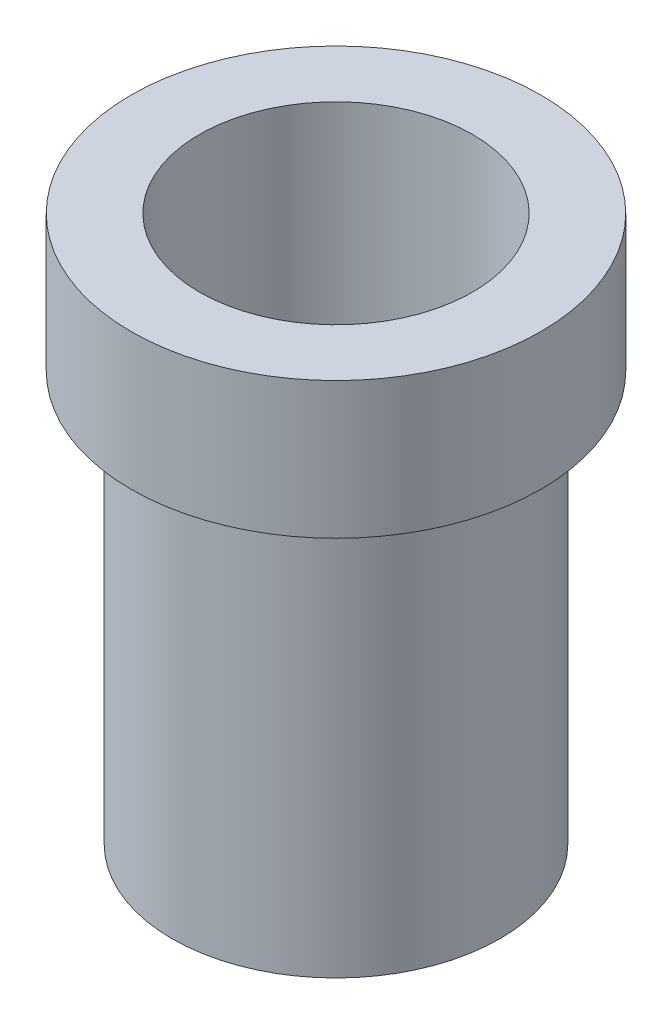
ISO-10303-21;
HEADER;
FILE_DESCRIPTION(('STEP AP214'),'2;1');
FILE_NAME('part.step','',(''),(''),'','','');
FILE_SCHEMA(('AUTOMOTIVE_DESIGN { 1 0 10303 214 1 1 1 1 }'));
ENDSEC;
DATA;
#1=APPLICATION_CONTEXT('core data for automotive mechanical design processes');
#2=APPLICATION_PROTOCOL_DEFINITION('international standard','automotive_design',2000,#1);
#3=PRODUCT_CONTEXT('',#1,'mechanical');
#4=PRODUCT('Part','Part','',(#3));
#5=PRODUCT_RELATED_PRODUCT_CATEGORY('part','',(#4));
#6=PRODUCT_DEFINITION_FORMATION('','',#4);
#7=PRODUCT_DEFINITION_CONTEXT('part definition',#1,'design');
#8=PRODUCT_DEFINITION('design','',#6,#7);
#9=PRODUCT_DEFINITION_SHAPE('','',#8);
#10=(LENGTH_UNIT() NAMED_UNIT(*) SI_UNIT(.MILLI.,.METRE.));
#11=(NAMED_UNIT(*) PLANE_ANGLE_UNIT() SI_UNIT($,.RADIAN.));
#12=(NAMED_UNIT(*) SI_UNIT($,.STERADIAN.) SOLID_ANGLE_UNIT());
#13=UNCERTAINTY_MEASURE_WITH_UNIT(LENGTH_MEASURE(1.E-05),#10,'distance_accuracy_value','');
#14=(GEOMETRIC_REPRESENTATION_CONTEXT(3) GLOBAL_UNCERTAINTY_ASSIGNED_CONTEXT((#13)) GLOBAL_UNIT_ASSIGNED_CONTEXT((#10,
#11,#12)) REPRESENTATION_CONTEXT('',''));
#15=CARTESIAN_POINT('',(0.,0.,0.));
#16=DIRECTION('',(0.,0.,1.));
#17=DIRECTION('',(1.,0.,0.));
#18=AXIS2_PLACEMENT_3D('',#15,#16,#17);
#19=CARTESIAN_POINT('',(0.,0.,0.));
#20=DIRECTION('',(0.,1.,0.));
#21=DIRECTION('',(0.,0.,1.));
#22=AXIS2_PLACEMENT_3D('',#19,#20,#21);
#23=PLANE('',#22);
#24=CARTESIAN_POINT('',(0.,0.,0.));
#25=DIRECTION('',(0.,1.,0.));
#26=DIRECTION('',(0.,0.,1.));
#27=AXIS2_PLACEMENT_3D('',#24,#25,#26);
#28=CIRCLE('',#27,7.5);
#29=CARTESIAN_POINT('',(0.,0.,7.5));
#30=VERTEX_POINT('',#29);
#31=EDGE_CURVE('E39',#30,#30,#28,.T.);
#32=ORIENTED_EDGE('',*,*,#31,.F.);
#33=EDGE_LOOP('',(#32));
#34=FACE_BOUND('',#33,.T.);
#35=CARTESIAN_POINT('',(0.,0.,0.));
#36=DIRECTION('',(0.,1.,0.));
#37=DIRECTION('',(0.,0.,1.));
#38=AXIS2_PLACEMENT_3D('',#35,#36,#37);
#39=CIRCLE('',#38,6.);
#40=CARTESIAN_POINT('',(0.,0.,6.));
#41=VERTEX_POINT('',#40);
#42=EDGE_CURVE('E10',#41,#41,#39,.F.);
#43=ORIENTED_EDGE('',*,*,#42,.F.);
#44=EDGE_LOOP('',(#43));
#45=FACE_BOUND('',#44,.T.);
#46=ADVANCED_FACE('F28',(#34,#45),#23,.F.);
#47=CARTESIAN_POINT('',(0.,5.,0.));
#48=DIRECTION('',(0.,-1.,0.));
#49=DIRECTION('',(0.,0.,-1.));
#50=AXIS2_PLACEMENT_3D('',#47,#48,#49);
#51=CYLINDRICAL_SURFACE('',#50,7.5);
#52=CARTESIAN_POINT('',(0.,5.,0.));
#53=DIRECTION('',(0.,1.,0.));
#54=DIRECTION('',(0.,0.,1.));
#55=AXIS2_PLACEMENT_3D('',#52,#53,#54);
#56=CIRCLE('',#55,7.5);
#57=CARTESIAN_POINT('',(0.,5.,7.5));
#58=VERTEX_POINT('',#57);
#59=EDGE_CURVE('E35',#58,#58,#56,.T.);
#60=ORIENTED_EDGE('',*,*,#59,.F.);
#61=EDGE_LOOP('',(#60));
#62=FACE_BOUND('',#61,.T.);
#63=ORIENTED_EDGE('',*,*,#31,.T.);
#64=EDGE_LOOP('',(#63));
#65=FACE_BOUND('',#64,.T.);
#66=ADVANCED_FACE('F30',(#62,#65),#51,.T.);
#67=CARTESIAN_POINT('',(0.,5.,0.));
#68=DIRECTION('',(0.,1.,0.));
#69=DIRECTION('',(0.,0.,1.));
#70=AXIS2_PLACEMENT_3D('',#67,#68,#69);
#71=PLANE('',#70);
#72=CARTESIAN_POINT('',(0.,5.,0.));
#73=DIRECTION('',(0.,1.,0.));
#74=DIRECTION('',(0.,0.,1.));
#75=AXIS2_PLACEMENT_3D('',#72,#73,#74);
#76=CIRCLE('',#75,5.);
#77=CARTESIAN_POINT('',(0.,5.,5.));
#78=VERTEX_POINT('',#77);
#79=EDGE_CURVE('E48',#78,#78,#76,.T.);
#80=ORIENTED_EDGE('',*,*,#79,.F.);
#81=EDGE_LOOP('',(#80));
#82=FACE_BOUND('',#81,.T.);
#83=ORIENTED_EDGE('',*,*,#59,.T.);
#84=EDGE_LOOP('',(#83));
#85=FACE_BOUND('',#84,.T.);
#86=ADVANCED_FACE('F57',(#82,#85),#71,.T.);
#87=CARTESIAN_POINT('',(0.,-15.,0.));
#88=DIRECTION('',(0.,1.,0.));
#89=DIRECTION('',(0.,0.,1.));
#90=AXIS2_PLACEMENT_3D('',#87,#88,#89);
#91=CYLINDRICAL_SURFACE('',#90,6.);
#92=CARTESIAN_POINT('',(0.,-15.,0.));
#93=DIRECTION('',(0.,-1.,0.));
#94=DIRECTION('',(0.,0.,-1.));
#95=AXIS2_PLACEMENT_3D('',#92,#93,#94);
#96=CIRCLE('',#95,6.);
#97=CARTESIAN_POINT('',(0.,-15.,-6.));
#98=VERTEX_POINT('',#97);
#99=EDGE_CURVE('E44',#98,#98,#96,.T.);
#100=ORIENTED_EDGE('',*,*,#99,.F.);
#101=EDGE_LOOP('',(#100));
#102=FACE_BOUND('',#101,.T.);
#103=ORIENTED_EDGE('',*,*,#42,.T.);
#104=EDGE_LOOP('',(#103));
#105=FACE_BOUND('',#104,.T.);
#106=ADVANCED_FACE('F59',(#102,#105),#91,.T.);
#107=CARTESIAN_POINT('',(0.,-15.,0.));
#108=DIRECTION('',(0.,-1.,0.));
#109=DIRECTION('',(0.,0.,-1.));
#110=AXIS2_PLACEMENT_3D('',#107,#108,#109);
#111=PLANE('',#110);
#112=CARTESIAN_POINT('',(0.,-15.,0.));
#113=DIRECTION('',(0.,-1.,0.));
#114=DIRECTION('',(0.,0.,-1.));
#115=AXIS2_PLACEMENT_3D('',#112,#113,#114);
#116=CIRCLE('',#115,5.);
#117=CARTESIAN_POINT('',(0.,-15.,-5.));
#118=VERTEX_POINT('',#117);
#119=EDGE_CURVE('E49',#118,#118,#116,.F.);
#120=ORIENTED_EDGE('',*,*,#119,.T.);
#121=EDGE_LOOP('',(#120));
#122=FACE_BOUND('',#121,.T.);
#123=ORIENTED_EDGE('',*,*,#99,.T.);
#124=EDGE_LOOP('',(#123));
#125=FACE_BOUND('',#124,.T.);
#126=ADVANCED_FACE('F65',(#122,#125),#111,.T.);
#127=CARTESIAN_POINT('',(0.,-15.001,0.));
#128=DIRECTION('',(0.,1.,0.));
#129=DIRECTION('',(0.,0.,1.));
#130=AXIS2_PLACEMENT_3D('',#127,#128,#129);
#131=CYLINDRICAL_SURFACE('',#130,5.);
#132=ORIENTED_EDGE('',*,*,#119,.F.);
#133=EDGE_LOOP('',(#132));
#134=FACE_BOUND('',#133,.T.);
#135=ORIENTED_EDGE('',*,*,#79,.T.);
#136=EDGE_LOOP('',(#135));
#137=FACE_BOUND('',#136,.T.);
#138=ADVANCED_FACE('F55',(#134,#137),#131,.F.);
#139=CLOSED_SHELL('',(#46,#66,#86,#106,#126,#138));
#140=MANIFOLD_SOLID_BREP('B2',#139);
#141=ADVANCED_BREP_SHAPE_REPRESENTATION('',(#18,#140),#14);
#142=SHAPE_DEFINITION_REPRESENTATION(#9,#141);
ENDSEC;
END-ISO-10303-21;
